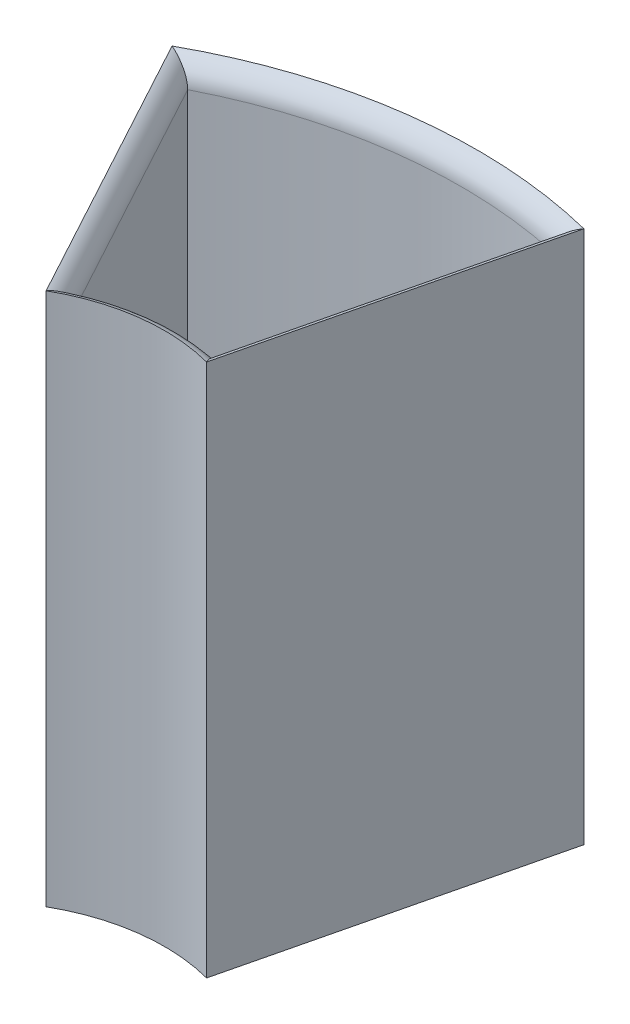
ISO-10303-21;
HEADER;
FILE_DESCRIPTION(('STEP AP214'),'2;1');
FILE_NAME('part.step','',(''),(''),'','','');
FILE_SCHEMA(('AUTOMOTIVE_DESIGN { 1 0 10303 214 1 1 1 1 }'));
ENDSEC;
DATA;
#1=APPLICATION_CONTEXT('core data for automotive mechanical design processes');
#2=APPLICATION_PROTOCOL_DEFINITION('international standard','automotive_design',2000,#1);
#3=PRODUCT_CONTEXT('',#1,'mechanical');
#4=PRODUCT('Part','Part','',(#3));
#5=PRODUCT_RELATED_PRODUCT_CATEGORY('part','',(#4));
#6=PRODUCT_DEFINITION_FORMATION('','',#4);
#7=PRODUCT_DEFINITION_CONTEXT('part definition',#1,'design');
#8=PRODUCT_DEFINITION('design','',#6,#7);
#9=PRODUCT_DEFINITION_SHAPE('','',#8);
#10=(LENGTH_UNIT() NAMED_UNIT(*) SI_UNIT(.MILLI.,.METRE.));
#11=(NAMED_UNIT(*) PLANE_ANGLE_UNIT() SI_UNIT($,.RADIAN.));
#12=(NAMED_UNIT(*) SI_UNIT($,.STERADIAN.) SOLID_ANGLE_UNIT());
#13=UNCERTAINTY_MEASURE_WITH_UNIT(LENGTH_MEASURE(1.E-05),#10,'distance_accuracy_value','');
#14=(GEOMETRIC_REPRESENTATION_CONTEXT(3) GLOBAL_UNCERTAINTY_ASSIGNED_CONTEXT((#13)) GLOBAL_UNIT_ASSIGNED_CONTEXT((#10,
#11,#12)) REPRESENTATION_CONTEXT('',''));
#15=CARTESIAN_POINT('',(0.,0.,0.));
#16=DIRECTION('',(0.,0.,1.));
#17=DIRECTION('',(1.,0.,0.));
#18=AXIS2_PLACEMENT_3D('',#15,#16,#17);
#19=CARTESIAN_POINT('',(0.,2.,0.));
#20=DIRECTION('',(0.,1.,0.));
#21=DIRECTION('',(0.,0.,1.));
#22=AXIS2_PLACEMENT_3D('',#19,#20,#21);
#23=PLANE('',#22);
#24=CARTESIAN_POINT('',(0.,2.,0.));
#25=DIRECTION('',(0.,1.,0.));
#26=DIRECTION('',(0.,0.,1.));
#27=AXIS2_PLACEMENT_3D('',#24,#25,#26);
#28=CIRCLE('',#27,56.);
#29=CARTESIAN_POINT('',(8.68565936566661,2.,-55.3223220895834));
#30=VERTEX_POINT('',#29);
#31=CARTESIAN_POINT('',(-22.6294347498133,2.,-51.2241025583069));
#32=VERTEX_POINT('',#31);
#33=EDGE_CURVE('E193',#30,#32,#28,.T.);
#34=ORIENTED_EDGE('',*,*,#33,.T.);
#35=DIRECTION('',(-0.476482957861193,0.,-0.879183707121469));
#36=VECTOR('',#35,1.);
#37=CARTESIAN_POINT('',(3.96686068085787,2.,-2.14988232303227));
#38=LINE('',#37,#36);
#39=CARTESIAN_POINT('',(-9.20030443380215,2.,-26.4453095713656));
#40=VERTEX_POINT('',#39);
#41=EDGE_CURVE('E202',#32,#40,#38,.F.);
#42=ORIENTED_EDGE('',*,*,#41,.T.);
#43=CARTESIAN_POINT('',(0.,2.,0.));
#44=DIRECTION('',(0.,1.,0.));
#45=DIRECTION('',(0.,0.,1.));
#46=AXIS2_PLACEMENT_3D('',#43,#44,#45);
#47=CIRCLE('',#46,28.);
#48=CARTESIAN_POINT('',(2.08519929447919,2.,-27.9222481885378));
#49=VERTEX_POINT('',#48);
#50=EDGE_CURVE('E199',#40,#49,#47,.F.);
#51=ORIENTED_EDGE('',*,*,#50,.T.);
#52=DIRECTION('',(0.23419288248431,0.,-0.972190153104674));
#53=VECTOR('',#52,1.);
#54=CARTESIAN_POINT('',(9.42633810452789,2.,-58.3970550571114));
#55=LINE('',#54,#53);
#56=EDGE_CURVE('E196',#49,#30,#55,.T.);
#57=ORIENTED_EDGE('',*,*,#56,.T.);
#58=EDGE_LOOP('',(#34,#42,#51,#57));
#59=FACE_BOUND('',#58,.T.);
#60=ADVANCED_FACE('F41',(#59),#23,.T.);
#61=CARTESIAN_POINT('',(-1.46993359146559,65.,-0.354095321523769));
#62=DIRECTION('',(-0.972190153104674,0.,-0.23419288248431));
#63=DIRECTION('',(-0.23419288248431,0.,0.972190153104674));
#64=AXIS2_PLACEMENT_3D('',#61,#62,#63);
#65=PLANE('',#64);
#66=DIRECTION('',(0.,-1.,0.));
#67=VECTOR('',#66,1.);
#68=CARTESIAN_POINT('',(12.3429085638419,65.,-57.6944764096585));
#69=LINE('',#68,#67);
#70=CARTESIAN_POINT('',(12.3429085638419,62.,-57.6944764096585));
#71=VERTEX_POINT('',#70);
#72=CARTESIAN_POINT('',(12.3429085638419,5.,-57.6944764096585));
#73=VERTEX_POINT('',#72);
#74=EDGE_CURVE('E136',#71,#73,#69,.T.);
#75=ORIENTED_EDGE('',*,*,#74,.T.);
#76=DIRECTION('',(0.23419288248431,0.,-0.972190153104674));
#77=VECTOR('',#76,1.);
#78=CARTESIAN_POINT('',(4.37417094919919,5.,-24.6143581778437));
#79=LINE('',#78,#77);
#80=CARTESIAN_POINT('',(4.37417094919919,5.,-24.6143581778437));
#81=VERTEX_POINT('',#80);
#82=EDGE_CURVE('E216',#73,#81,#79,.F.);
#83=ORIENTED_EDGE('',*,*,#82,.T.);
#84=DIRECTION('',(0.,-1.,0.));
#85=VECTOR('',#84,1.);
#86=CARTESIAN_POINT('',(4.37417094919919,65.,-24.6143581778437));
#87=LINE('',#86,#85);
#88=CARTESIAN_POINT('',(4.37417094919919,62.,-24.6143581778437));
#89=VERTEX_POINT('',#88);
#90=EDGE_CURVE('E175',#89,#81,#87,.T.);
#91=ORIENTED_EDGE('',*,*,#90,.F.);
#92=DIRECTION('',(0.23419288248431,0.,-0.972190153104674));
#93=VECTOR('',#92,1.);
#94=CARTESIAN_POINT('',(-1.46993359146559,62.,-0.354095321523769));
#95=LINE('',#94,#93);
#96=EDGE_CURVE('E213',#89,#71,#95,.T.);
#97=ORIENTED_EDGE('',*,*,#96,.T.);
#98=EDGE_LOOP('',(#75,#83,#91,#97));
#99=FACE_BOUND('',#98,.T.);
#100=ADVANCED_FACE('F314',(#99),#65,.T.);
#101=CARTESIAN_POINT('',(0.,65.,0.));
#102=DIRECTION('',(0.,-1.,0.));
#103=DIRECTION('',(0.,0.,-1.));
#104=AXIS2_PLACEMENT_3D('',#101,#102,#103);
#105=CYLINDRICAL_SURFACE('',#104,25.);
#106=ORIENTED_EDGE('',*,*,#90,.T.);
#107=CARTESIAN_POINT('',(0.,5.,0.));
#108=DIRECTION('',(0.,1.,0.));
#109=DIRECTION('',(0.,0.,1.));
#110=AXIS2_PLACEMENT_3D('',#107,#108,#109);
#111=CIRCLE('',#110,25.);
#112=CARTESIAN_POINT('',(-10.5609587870372,5.,-22.6597914707638));
#113=VERTEX_POINT('',#112);
#114=EDGE_CURVE('E210',#81,#113,#111,.T.);
#115=ORIENTED_EDGE('',*,*,#114,.T.);
#116=DIRECTION('',(0.,-1.,0.));
#117=VECTOR('',#116,1.);
#118=CARTESIAN_POINT('',(-10.5609587870372,65.,-22.6597914707638));
#119=LINE('',#118,#117);
#120=CARTESIAN_POINT('',(-10.5609587870372,62.,-22.6597914707638));
#121=VERTEX_POINT('',#120);
#122=EDGE_CURVE('E171',#121,#113,#119,.T.);
#123=ORIENTED_EDGE('',*,*,#122,.F.);
#124=CARTESIAN_POINT('',(0.,62.,0.));
#125=DIRECTION('',(0.,1.,0.));
#126=DIRECTION('',(0.,0.,1.));
#127=AXIS2_PLACEMENT_3D('',#124,#125,#126);
#128=CIRCLE('',#127,25.);
#129=EDGE_CURVE('E206',#121,#89,#128,.F.);
#130=ORIENTED_EDGE('',*,*,#129,.T.);
#131=EDGE_LOOP('',(#106,#115,#123,#130));
#132=FACE_BOUND('',#131,.T.);
#133=ADVANCED_FACE('F320',(#132),#105,.T.);
#134=CARTESIAN_POINT('',(1.32930955949347,65.,-0.720433449448689));
#135=DIRECTION('',(-0.879183707121469,0.,0.476482957861193));
#136=DIRECTION('',(0.476482957861193,0.,0.879183707121469));
#137=AXIS2_PLACEMENT_3D('',#134,#135,#136);
#138=PLANE('',#137);
#139=ORIENTED_EDGE('',*,*,#122,.T.);
#140=DIRECTION('',(-0.476482957861193,0.,-0.879183707121469));
#141=VECTOR('',#140,1.);
#142=CARTESIAN_POINT('',(1.32930955949347,5.,-0.720433449448689));
#143=LINE('',#142,#141);
#144=CARTESIAN_POINT('',(-26.7739522340054,5.,-52.5752363929179));
#145=VERTEX_POINT('',#144);
#146=EDGE_CURVE('E189',#113,#145,#143,.T.);
#147=ORIENTED_EDGE('',*,*,#146,.T.);
#148=DIRECTION('',(0.,-1.,0.));
#149=VECTOR('',#148,1.);
#150=CARTESIAN_POINT('',(-26.7739522340054,65.,-52.5752363929179));
#151=LINE('',#150,#149);
#152=CARTESIAN_POINT('',(-26.7739522340054,62.,-52.5752363929179));
#153=VERTEX_POINT('',#152);
#154=EDGE_CURVE('E167',#153,#145,#151,.T.);
#155=ORIENTED_EDGE('',*,*,#154,.F.);
#156=DIRECTION('',(-0.476482957861193,0.,-0.879183707121469));
#157=VECTOR('',#156,1.);
#158=CARTESIAN_POINT('',(-10.5609587870372,62.,-22.6597914707638));
#159=LINE('',#158,#157);
#160=EDGE_CURVE('E179',#153,#121,#159,.F.);
#161=ORIENTED_EDGE('',*,*,#160,.T.);
#162=EDGE_LOOP('',(#139,#147,#155,#161));
#163=FACE_BOUND('',#162,.T.);
#164=ADVANCED_FACE('F339',(#163),#138,.F.);
#165=CARTESIAN_POINT('',(0.,65.,0.));
#166=DIRECTION('',(0.,-1.,0.));
#167=DIRECTION('',(0.,0.,-1.));
#168=AXIS2_PLACEMENT_3D('',#165,#166,#167);
#169=CYLINDRICAL_SURFACE('',#168,23.);
#170=DIRECTION('',(0.,-1.,0.));
#171=VECTOR('',#170,1.);
#172=CARTESIAN_POINT('',(5.85967035705195,65.,-22.2410490603903));
#173=LINE('',#172,#171);
#174=CARTESIAN_POINT('',(5.85967035705195,64.8284271247462,-22.2410490603903));
#175=VERTEX_POINT('',#174);
#176=CARTESIAN_POINT('',(5.85967035705195,0.,-22.2410490603903));
#177=VERTEX_POINT('',#176);
#178=EDGE_CURVE('E125',#175,#177,#173,.T.);
#179=ORIENTED_EDGE('',*,*,#178,.F.);
#180=CARTESIAN_POINT('',(0.,64.8284271247462,0.));
#181=DIRECTION('',(0.,1.,0.));
#182=DIRECTION('',(0.,0.,1.));
#183=AXIS2_PLACEMENT_3D('',#180,#181,#182);
#184=CIRCLE('',#183,23.);
#185=CARTESIAN_POINT('',(-11.385698648489,64.8284271247462,-19.9841403689475));
#186=VERTEX_POINT('',#185);
#187=EDGE_CURVE('E225',#175,#186,#184,.T.);
#188=ORIENTED_EDGE('',*,*,#187,.T.);
#189=DIRECTION('',(0.,-1.,0.));
#190=VECTOR('',#189,1.);
#191=CARTESIAN_POINT('',(-11.385698648489,65.,-19.9841403689475));
#192=LINE('',#191,#190);
#193=CARTESIAN_POINT('',(-11.385698648489,0.,-19.9841403689475));
#194=VERTEX_POINT('',#193);
#195=EDGE_CURVE('E150',#186,#194,#192,.T.);
#196=ORIENTED_EDGE('',*,*,#195,.T.);
#197=CARTESIAN_POINT('',(0.,0.,0.));
#198=DIRECTION('',(0.,1.,0.));
#199=DIRECTION('',(0.,0.,1.));
#200=AXIS2_PLACEMENT_3D('',#197,#198,#199);
#201=CIRCLE('',#200,23.);
#202=EDGE_CURVE('E143',#177,#194,#201,.T.);
#203=ORIENTED_EDGE('',*,*,#202,.F.);
#204=EDGE_LOOP('',(#179,#188,#196,#203));
#205=FACE_BOUND('',#204,.T.);
#206=ADVANCED_FACE('F149',(#205),#169,.F.);
#207=CARTESIAN_POINT('',(0.474446714743756,65.,0.114290443444852));
#208=DIRECTION('',(-0.972190153104674,0.,-0.23419288248431));
#209=DIRECTION('',(-0.23419288248431,0.,0.972190153104674));
#210=AXIS2_PLACEMENT_3D('',#207,#208,#209);
#211=PLANE('',#210);
#212=DIRECTION('',(0.,-1.,0.));
#213=VECTOR('',#212,1.);
#214=CARTESIAN_POINT('',(14.7597553599294,65.,-59.1874110070295));
#215=LINE('',#214,#213);
#216=CARTESIAN_POINT('',(14.7597553599294,64.8284271247462,-59.1874110070295));
#217=VERTEX_POINT('',#216);
#218=CARTESIAN_POINT('',(14.7597553599294,0.,-59.1874110070295));
#219=VERTEX_POINT('',#218);
#220=EDGE_CURVE('E137',#217,#219,#215,.T.);
#221=ORIENTED_EDGE('',*,*,#220,.F.);
#222=DIRECTION('',(0.23419288248431,0.,-0.972190153104674));
#223=VECTOR('',#222,1.);
#224=CARTESIAN_POINT('',(10.3097128584907,64.8284271247462,-40.7142300337099));
#225=LINE('',#224,#223);
#226=EDGE_CURVE('E56',#217,#175,#225,.F.);
#227=ORIENTED_EDGE('',*,*,#226,.T.);
#228=ORIENTED_EDGE('',*,*,#178,.T.);
#229=DIRECTION('',(0.23419288248431,0.,-0.972190153104674));
#230=VECTOR('',#229,1.);
#231=CARTESIAN_POINT('',(0.474446714743756,0.,0.114290443444852));
#232=LINE('',#231,#230);
#233=EDGE_CURVE('E128',#177,#219,#232,.T.);
#234=ORIENTED_EDGE('',*,*,#233,.T.);
#235=EDGE_LOOP('',(#221,#227,#228,#234));
#236=FACE_BOUND('',#235,.T.);
#237=ADVANCED_FACE('F127',(#236),#211,.F.);
#238=CARTESIAN_POINT('',(0.,65.,0.));
#239=DIRECTION('',(0.,-1.,0.));
#240=DIRECTION('',(0.,0.,-1.));
#241=AXIS2_PLACEMENT_3D('',#238,#239,#240);
#242=CYLINDRICAL_SURFACE('',#241,61.);
#243=DIRECTION('',(0.,-1.,0.));
#244=VECTOR('',#243,1.);
#245=CARTESIAN_POINT('',(-29.4935881044002,65.,-53.3959573444281));
#246=LINE('',#245,#244);
#247=CARTESIAN_POINT('',(-29.4935881044002,64.8284271247462,-53.3959573444281));
#248=VERTEX_POINT('',#247);
#249=CARTESIAN_POINT('',(-29.4935881044002,0.,-53.3959573444281));
#250=VERTEX_POINT('',#249);
#251=EDGE_CURVE('E182',#248,#250,#246,.T.);
#252=ORIENTED_EDGE('',*,*,#251,.F.);
#253=CARTESIAN_POINT('',(0.,64.8284271247462,0.));
#254=DIRECTION('',(0.,-1.,0.));
#255=DIRECTION('',(0.,0.,-1.));
#256=AXIS2_PLACEMENT_3D('',#253,#254,#255);
#257=CIRCLE('',#256,61.);
#258=EDGE_CURVE('E11',#248,#217,#257,.T.);
#259=ORIENTED_EDGE('',*,*,#258,.T.);
#260=ORIENTED_EDGE('',*,*,#220,.T.);
#261=CARTESIAN_POINT('',(0.,0.,0.));
#262=DIRECTION('',(0.,1.,0.));
#263=DIRECTION('',(0.,0.,1.));
#264=AXIS2_PLACEMENT_3D('',#261,#262,#263);
#265=CIRCLE('',#264,61.);
#266=EDGE_CURVE('E146',#219,#250,#265,.T.);
#267=ORIENTED_EDGE('',*,*,#266,.T.);
#268=EDGE_LOOP('',(#252,#259,#260,#267));
#269=FACE_BOUND('',#268,.T.);
#270=ADVANCED_FACE('F336',(#269),#242,.T.);
#271=CARTESIAN_POINT('',(-0.429057854749474,65.,0.232532466273698));
#272=DIRECTION('',(-0.879183707121469,0.,0.476482957861193));
#273=DIRECTION('',(0.476482957861193,0.,0.879183707121469));
#274=AXIS2_PLACEMENT_3D('',#271,#272,#273);
#275=PLANE('',#274);
#276=ORIENTED_EDGE('',*,*,#195,.F.);
#277=DIRECTION('',(0.476482957861193,0.,0.879183707121469));
#278=VECTOR('',#277,1.);
#279=CARTESIAN_POINT('',(-20.4396433764446,64.8284271247462,-36.6900488566878));
#280=LINE('',#279,#278);
#281=EDGE_CURVE('E70',#186,#248,#280,.F.);
#282=ORIENTED_EDGE('',*,*,#281,.T.);
#283=ORIENTED_EDGE('',*,*,#251,.T.);
#284=DIRECTION('',(-0.476482957861193,0.,-0.879183707121469));
#285=VECTOR('',#284,1.);
#286=CARTESIAN_POINT('',(-0.429057854749474,0.,0.232532466273698));
#287=LINE('',#286,#285);
#288=EDGE_CURVE('E161',#194,#250,#287,.T.);
#289=ORIENTED_EDGE('',*,*,#288,.F.);
#290=EDGE_LOOP('',(#276,#282,#283,#289));
#291=FACE_BOUND('',#290,.T.);
#292=ADVANCED_FACE('F330',(#291),#275,.T.);
#293=CARTESIAN_POINT('',(0.,65.,0.));
#294=DIRECTION('',(0.,-1.,0.));
#295=DIRECTION('',(0.,0.,-1.));
#296=AXIS2_PLACEMENT_3D('',#293,#294,#295);
#297=CYLINDRICAL_SURFACE('',#296,59.);
#298=ORIENTED_EDGE('',*,*,#154,.T.);
#299=CARTESIAN_POINT('',(0.,5.,0.));
#300=DIRECTION('',(0.,1.,0.));
#301=DIRECTION('',(0.,0.,1.));
#302=AXIS2_PLACEMENT_3D('',#299,#300,#301);
#303=CIRCLE('',#302,59.);
#304=EDGE_CURVE('E222',#145,#73,#303,.F.);
#305=ORIENTED_EDGE('',*,*,#304,.T.);
#306=ORIENTED_EDGE('',*,*,#74,.F.);
#307=CARTESIAN_POINT('',(0.,62.,0.));
#308=DIRECTION('',(0.,1.,0.));
#309=DIRECTION('',(0.,0.,1.));
#310=AXIS2_PLACEMENT_3D('',#307,#308,#309);
#311=CIRCLE('',#310,59.);
#312=EDGE_CURVE('E219',#71,#153,#311,.T.);
#313=ORIENTED_EDGE('',*,*,#312,.T.);
#314=EDGE_LOOP('',(#298,#305,#306,#313));
#315=FACE_BOUND('',#314,.T.);
#316=ADVANCED_FACE('F326',(#315),#297,.F.);
#317=CARTESIAN_POINT('',(0.,0.,0.));
#318=DIRECTION('',(0.,1.,0.));
#319=DIRECTION('',(0.,0.,1.));
#320=AXIS2_PLACEMENT_3D('',#317,#318,#319);
#321=PLANE('',#320);
#322=ORIENTED_EDGE('',*,*,#202,.T.);
#323=ORIENTED_EDGE('',*,*,#288,.T.);
#324=ORIENTED_EDGE('',*,*,#266,.F.);
#325=ORIENTED_EDGE('',*,*,#233,.F.);
#326=EDGE_LOOP('',(#322,#323,#324,#325));
#327=FACE_BOUND('',#326,.T.);
#328=ADVANCED_FACE('F141',(#327),#321,.F.);
#329=CARTESIAN_POINT('',(-4.38650405077962,5.,-1.0566739689767));
#330=DIRECTION('',(-0.23419288248431,0.,0.972190153104674));
#331=DIRECTION('',(0.972190153104674,0.,0.23419288248431));
#332=AXIS2_PLACEMENT_3D('',#329,#330,#331);
#333=CYLINDRICAL_SURFACE('',#332,3.);
#334=CARTESIAN_POINT('',(12.3429085638419,5.,-57.6944764096585));
#335=CARTESIAN_POINT('',(12.3429288660334,4.93337046723494,-57.6944887474847));
#336=CARTESIAN_POINT('',(12.3402179017331,4.86675388598784,-57.6927826438431));
#337=CARTESIAN_POINT('',(12.3294897373083,4.73417143842667,-57.6860286935827));
#338=CARTESIAN_POINT('',(12.3214767431209,4.66820509835827,-57.6809834957638));
#339=CARTESIAN_POINT('',(12.3003915406696,4.53800357085029,-57.6677036468582));
#340=CARTESIAN_POINT('',(12.2873634926513,4.47375836767791,-57.6594968350051));
#341=CARTESIAN_POINT('',(12.2565269053916,4.34690426820063,-57.6400634453613));
#342=CARTESIAN_POINT('',(12.2387176762911,4.28429560945834,-57.6288364317965));
#343=CARTESIAN_POINT('',(12.1787163428119,4.09993013516925,-57.5909911590831));
#344=CARTESIAN_POINT('',(12.129865336399,3.98113000218222,-57.5601550772575));
#345=CARTESIAN_POINT('',(12.0173939876592,3.75369409817656,-57.4890503554816));
#346=CARTESIAN_POINT('',(11.9537400583254,3.64508224230689,-57.4487602630065));
#347=CARTESIAN_POINT('',(11.7858772044742,3.3964422998175,-57.3423137198884));
#348=CARTESIAN_POINT('',(11.6757856212972,3.26200945995745,-57.2723523570856));
#349=CARTESIAN_POINT('',(11.4391420488641,3.01575307544449,-57.1215009232084));
#350=CARTESIAN_POINT('',(11.3125588163913,2.90397350121494,-57.0405900969565));
#351=CARTESIAN_POINT('',(10.993395407197,2.66005141986524,-56.8358852071737));
#352=CARTESIAN_POINT('',(10.7951686690945,2.53860058397452,-56.7081930470803));
#353=CARTESIAN_POINT('',(10.3858585301138,2.3344031661369,-56.4431306614665));
#354=CARTESIAN_POINT('',(10.1747570193466,2.2517125934809,-56.3057467587539));
#355=CARTESIAN_POINT('',(9.75293767688449,2.12380147081336,-56.0297179360774));
#356=CARTESIAN_POINT('',(9.54243348998027,2.07744296751316,-55.8912615075257));
#357=CARTESIAN_POINT('',(9.11935840827955,2.01579214121463,-55.6114738021405));
#358=CARTESIAN_POINT('',(8.90679250839941,2.00043766454001,-55.4701488517912));
#359=CARTESIAN_POINT('',(8.69174030572387,2.00000308038561,-55.3263876422372));
#360=CARTESIAN_POINT('',(8.68869977603637,2.00000000588677,-55.3243549056962));
#361=CARTESIAN_POINT('',(8.68565936566661,2.,-55.3223220895834));
#362=B_SPLINE_CURVE_WITH_KNOTS('',3,(#334,#335,#336,#337,#338,#339,#340,#341,#342,#343,#344,
#345,#346,#347,#348,#349,#350,#351,#352,#353,#354,#355,#356,#357,#358,#359,#360,#361),
.UNSPECIFIED.,.F.,.F.,(4,2,2,2,2,2,2,2,2,2,2,2,2,4),(0.,0.199790574429052,0.399422850850688,
0.597336047832153,0.795277816339575,1.18964085340849,1.58490756223034,2.14371959352384,
2.70360611465259,3.49500121373229,4.28753639440931,5.0541283888798,5.81918206689892,
5.83015437267743),.UNSPECIFIED.);
#363=EDGE_CURVE('E156',#30,#73,#362,.F.);
#364=ORIENTED_EDGE('',*,*,#363,.F.);
#365=ORIENTED_EDGE('',*,*,#56,.F.);
#366=CARTESIAN_POINT('',(4.37417094919919,5.,-24.6143581778437));
#367=CARTESIAN_POINT('',(4.37418315299722,4.93125301018801,-24.6143379149249));
#368=CARTESIAN_POINT('',(4.37239491344077,4.86251884545374,-24.6170732864234));
#369=CARTESIAN_POINT('',(4.36531178061874,4.7257060756013,-24.6278994368479));
#370=CARTESIAN_POINT('',(4.36001953488606,4.65762701487462,-24.6359861724245));
#371=CARTESIAN_POINT('',(4.34607973212947,4.52320207544919,-24.6572720181164));
#372=CARTESIAN_POINT('',(4.33746003508428,4.45684656398287,-24.6704286773691));
#373=CARTESIAN_POINT('',(4.31703397584652,4.32579305603028,-24.7015756159135));
#374=CARTESIAN_POINT('',(4.3052271728883,4.26109529016053,-24.719566563769));
#375=CARTESIAN_POINT('',(4.26538906927016,4.07050029097725,-24.7801980917038));
#376=CARTESIAN_POINT('',(4.23288635126831,3.94760313964668,-24.8295797538118));
#377=CARTESIAN_POINT('',(4.15775737161105,3.71219336196557,-24.9433306727212));
#378=CARTESIAN_POINT('',(4.11510886223521,3.59970432227003,-25.0077328604034));
#379=CARTESIAN_POINT('',(4.00323077134318,3.34467443425928,-25.1759886091932));
#380=CARTESIAN_POINT('',(3.93012058244796,3.20751581808216,-25.2854339680241));
#381=CARTESIAN_POINT('',(3.7718896601732,2.95619142243703,-25.5207506559777));
#382=CARTESIAN_POINT('',(3.68674698780477,2.84206858849436,-25.6466519572214));
#383=CARTESIAN_POINT('',(3.4786658492601,2.60320992396438,-25.9521860952219));
#384=CARTESIAN_POINT('',(3.35237643413448,2.48685749154731,-26.1360804027908));
#385=CARTESIAN_POINT('',(3.08917673389787,2.29167767734002,-26.515620393135));
#386=CARTESIAN_POINT('',(2.95225888117402,2.21287732355222,-26.711274426225));
#387=CARTESIAN_POINT('',(2.69534490312593,2.10190766484455,-27.0748659856854));
#388=CARTESIAN_POINT('',(2.57641316458715,2.06409907015512,-27.2418816642659));
#389=CARTESIAN_POINT('',(2.3357143197521,2.01339930523404,-27.5772440263103));
#390=CARTESIAN_POINT('',(2.21395387746367,2.00045460268006,-27.7455870649341));
#391=CARTESIAN_POINT('',(2.08952957492837,2.00000392235841,-27.9163078740774));
#392=CARTESIAN_POINT('',(2.08736451003586,2.00000000082004,-27.91927812821));
#393=CARTESIAN_POINT('',(2.08519929447919,2.,-27.9222481885378));
#394=B_SPLINE_CURVE_WITH_KNOTS('',3,(#366,#367,#368,#369,#370,#371,#372,#373,#374,#375,#376,
#377,#378,#379,#380,#381,#382,#383,#384,#385,#386,#387,#388,#389,#390,#391,#392,#393),
.UNSPECIFIED.,.F.,.F.,(4,2,2,2,2,2,2,2,2,2,2,2,2,4),(0.,0.206142437845146,0.412129297477611,
0.616427628855155,0.820754228469359,1.22790419753151,1.63595533210953,2.20309585575548,
2.77128412571264,3.52214025073019,4.27353598913288,4.89759727588257,5.52031343686156,
5.53134018441532),.UNSPECIFIED.);
#395=EDGE_CURVE('E152',#81,#49,#394,.T.);
#396=ORIENTED_EDGE('',*,*,#395,.F.);
#397=ORIENTED_EDGE('',*,*,#82,.F.);
#398=EDGE_LOOP('',(#364,#365,#396,#397));
#399=FACE_BOUND('',#398,.T.);
#400=ADVANCED_FACE('F270',(#399),#333,.F.);
#401=CARTESIAN_POINT('',(0.,5.,0.));
#402=DIRECTION('',(0.,1.,0.));
#403=DIRECTION('',(0.,0.,1.));
#404=AXIS2_PLACEMENT_3D('',#401,#402,#403);
#405=TOROIDAL_SURFACE('',#404,28.,3.);
#406=ORIENTED_EDGE('',*,*,#395,.T.);
#407=ORIENTED_EDGE('',*,*,#50,.F.);
#408=CARTESIAN_POINT('',(-10.5609587870372,5.,-22.6597914707638));
#409=CARTESIAN_POINT('',(-10.5609653655165,4.931253010188,-22.6597687498005));
#410=CARTESIAN_POINT('',(-10.5599412517593,4.86251884545373,-22.6628721751594));
#411=CARTESIAN_POINT('',(-10.5558825908979,4.7257060756013,-22.6751564568071));
#412=CARTESIAN_POINT('',(-10.5528495616755,4.65762701487461,-22.6843327246169));
#413=CARTESIAN_POINT('',(-10.5448567749941,4.52320207544919,-22.7084888975087));
#414=CARTESIAN_POINT('',(-10.5399130152359,4.45684656398286,-22.7234206120551));
#415=CARTESIAN_POINT('',(-10.5281900012097,4.32579305603027,-22.7587749133325));
#416=CARTESIAN_POINT('',(-10.5214104930637,4.26109529016052,-22.7791982595356));
#417=CARTESIAN_POINT('',(-10.4985165524644,4.07050029097725,-22.8480395564688));
#418=CARTESIAN_POINT('',(-10.4798159941617,3.94760313964668,-22.9041222128718));
#419=CARTESIAN_POINT('',(-10.436489077719,3.71219336196556,-23.0333755047009));
#420=CARTESIAN_POINT('',(-10.4118496953206,3.59970432227002,-23.1065836870663));
#421=CARTESIAN_POINT('',(-10.3470371971265,3.34467443425926,-23.2979630075279));
#422=CARTESIAN_POINT('',(-10.3045531192145,3.20751581808213,-23.4225362366499));
#423=CARTESIAN_POINT('',(-10.2122058540791,2.95619142243701,-23.690646197329));
#424=CARTESIAN_POINT('',(-10.1623291795437,2.84206858849435,-23.8342175372621));
#425=CARTESIAN_POINT('',(-10.0398798211076,2.60320992396439,-24.1830083403524));
#426=CARTESIAN_POINT('',(-9.96516565838874,2.48685749154733,-24.3932080706524));
#427=CARTESIAN_POINT('',(-9.80849816781054,2.29167767734004,-24.8276962567645));
#428=CARTESIAN_POINT('',(-9.72653967601092,2.21287732355223,-25.0519947290751));
#429=CARTESIAN_POINT('',(-9.57184215610546,2.10190766484453,-25.4694540583066));
#430=CARTESIAN_POINT('',(-9.49989444677685,2.0640990701551,-25.6614502104711));
#431=CARTESIAN_POINT('',(-9.35360166012747,2.01339930523404,-26.0474583300169));
#432=CARTESIAN_POINT('',(-9.27926208444911,2.00045460268006,-26.2414650604345));
#433=CARTESIAN_POINT('',(-9.20296024017392,2.00000392235841,-26.4384549847863));
#434=CARTESIAN_POINT('',(-9.20163243471936,2.00000000082004,-26.4418823523295));
#435=CARTESIAN_POINT('',(-9.20030443380215,2.,-26.4453095713656));
#436=B_SPLINE_CURVE_WITH_KNOTS('',3,(#408,#409,#410,#411,#412,#413,#414,#415,#416,#417,#418,
#419,#420,#421,#422,#423,#424,#425,#426,#427,#428,#429,#430,#431,#432,#433,#434,#435),
.UNSPECIFIED.,.F.,.F.,(4,2,2,2,2,2,2,2,2,2,2,2,2,4),(0.,0.206142437845148,0.412129297477615,
0.616427628855159,0.820754228469363,1.22790419753151,1.63595533210953,2.20309585575551,
2.77128412571265,3.5221402507301,4.27353598913288,4.89759727588266,5.52031343686155,
5.5313401844153),.UNSPECIFIED.);
#437=EDGE_CURVE('E241',#113,#40,#436,.T.);
#438=ORIENTED_EDGE('',*,*,#437,.F.);
#439=ORIENTED_EDGE('',*,*,#114,.F.);
#440=EDGE_LOOP('',(#406,#407,#438,#439));
#441=FACE_BOUND('',#440,.T.);
#442=ADVANCED_FACE('F254',(#441),#405,.F.);
#443=CARTESIAN_POINT('',(0.,5.,0.));
#444=DIRECTION('',(0.,1.,0.));
#445=DIRECTION('',(0.,0.,1.));
#446=AXIS2_PLACEMENT_3D('',#443,#444,#445);
#447=TOROIDAL_SURFACE('',#446,56.,3.);
#448=ORIENTED_EDGE('',*,*,#363,.T.);
#449=ORIENTED_EDGE('',*,*,#304,.F.);
#450=CARTESIAN_POINT('',(-26.7739522340054,5.,-52.5752363929179));
#451=CARTESIAN_POINT('',(-26.7739750274088,4.93337046723494,-52.5752430908055));
#452=CARTESIAN_POINT('',(-26.7709163235988,4.86675388598784,-52.574292066055));
#453=CARTESIAN_POINT('',(-26.7588114377349,4.73417143842667,-52.5705262866845));
#454=CARTESIAN_POINT('',(-26.7497700015981,4.66820509835827,-52.5677130093315));
#455=CARTESIAN_POINT('',(-26.7259775430329,4.53800357085029,-52.5603063187891));
#456=CARTESIAN_POINT('',(-26.7112763576172,4.47375836767791,-52.5557284433724));
#457=CARTESIAN_POINT('',(-26.6764774029331,4.34690426820063,-52.544884804695));
#458=CARTESIAN_POINT('',(-26.656378854899,4.28429560945834,-52.5386187978596));
#459=CARTESIAN_POINT('',(-26.5886593512468,4.09993013516925,-52.5174884047935));
#460=CARTESIAN_POINT('',(-26.5335183607424,3.98113000218222,-52.500261799321));
#461=CARTESIAN_POINT('',(-26.406537122821,3.75369409817656,-52.4604943382237));
#462=CARTESIAN_POINT('',(-26.3346588990654,3.64508224230689,-52.437941395599));
#463=CARTESIAN_POINT('',(-26.1450569609394,3.3964422998175,-52.3782764200797));
#464=CARTESIAN_POINT('',(-26.0206695689429,3.26200945995746,-52.3390014193292));
#465=CARTESIAN_POINT('',(-25.7531763991032,3.01575307544449,-52.2541265728446));
#466=CARTESIAN_POINT('',(-25.6100350892298,2.90397350121494,-52.2085147108376));
#467=CARTESIAN_POINT('',(-25.2489428343631,2.66005141986523,-52.0928351657795));
#468=CARTESIAN_POINT('',(-25.0245323784281,2.5386005839745,-52.0204537129403));
#469=CARTESIAN_POINT('',(-24.5607972917942,2.33440316613689,-51.8696471230168));
#470=CARTESIAN_POINT('',(-24.3214516414999,2.25171259348089,-51.7912134296324));
#471=CARTESIAN_POINT('',(-23.8428065967425,2.12380147081337,-51.6330287598552));
#472=CARTESIAN_POINT('',(-23.6037621572317,2.07744296751317,-51.553404949029));
#473=CARTESIAN_POINT('',(-23.1229363768542,2.01579214121464,-51.3919111294411));
#474=CARTESIAN_POINT('',(-22.8811614907045,2.00043766454001,-51.3100459487451));
#475=CARTESIAN_POINT('',(-22.6363571027707,2.00000308038561,-51.226466364537));
#476=CARTESIAN_POINT('',(-22.6328958788805,2.00000000588677,-51.2252845152202));
#477=CARTESIAN_POINT('',(-22.6294347498133,2.,-51.2241025583069));
#478=B_SPLINE_CURVE_WITH_KNOTS('',3,(#450,#451,#452,#453,#454,#455,#456,#457,#458,#459,#460,
#461,#462,#463,#464,#465,#466,#467,#468,#469,#470,#471,#472,#473,#474,#475,#476,#477),
.UNSPECIFIED.,.F.,.F.,(4,2,2,2,2,2,2,2,2,2,2,2,2,4),(0.,0.199790574429052,0.399422850850688,
0.597336047832154,0.795277816339575,1.18964085340849,1.58490756223034,2.14371959352383,
2.70360611465259,3.49500121373236,4.28753639440932,5.05412838887971,5.81918206689891,
5.83015437267742),.UNSPECIFIED.);
#479=EDGE_CURVE('E232',#32,#145,#478,.F.);
#480=ORIENTED_EDGE('',*,*,#479,.F.);
#481=ORIENTED_EDGE('',*,*,#33,.F.);
#482=EDGE_LOOP('',(#448,#449,#480,#481));
#483=FACE_BOUND('',#482,.T.);
#484=ADVANCED_FACE('F251',(#483),#447,.F.);
#485=CARTESIAN_POINT('',(3.96686068085787,5.,-2.14988232303227));
#486=DIRECTION('',(-0.476482957861193,0.,-0.879183707121469));
#487=DIRECTION('',(-0.879183707121469,0.,0.476482957861193));
#488=AXIS2_PLACEMENT_3D('',#485,#486,#487);
#489=CYLINDRICAL_SURFACE('',#488,3.);
#490=ORIENTED_EDGE('',*,*,#437,.T.);
#491=ORIENTED_EDGE('',*,*,#41,.F.);
#492=ORIENTED_EDGE('',*,*,#479,.T.);
#493=ORIENTED_EDGE('',*,*,#146,.F.);
#494=EDGE_LOOP('',(#490,#491,#492,#493));
#495=FACE_BOUND('',#494,.T.);
#496=ADVANCED_FACE('F248',(#495),#489,.F.);
#497=CARTESIAN_POINT('',(0.,62.,0.));
#498=DIRECTION('',(0.,1.,0.));
#499=DIRECTION('',(0.,0.,1.));
#500=AXIS2_PLACEMENT_3D('',#497,#498,#499);
#501=TOROIDAL_SURFACE('',#500,62.,3.);
#502=CARTESIAN_POINT('',(-30.8416754332027,59.,-53.7846730628065));
#503=CARTESIAN_POINT('',(-30.8381624881006,59.0000000045595,-53.7836752634881));
#504=CARTESIAN_POINT('',(-30.8346494676755,59.000003418577,-53.7826773239));
#505=CARTESIAN_POINT('',(-30.5215285323779,59.0006116207127,-53.6937188378344));
#506=CARTESIAN_POINT('',(-30.2113994467926,59.0276961522276,-53.6046875764411));
#507=CARTESIAN_POINT('',(-29.7533115905821,59.1084529787516,-53.4718358259983));
#508=CARTESIAN_POINT('',(-29.6015368529418,59.1421559642639,-53.4275898412854));
#509=CARTESIAN_POINT('',(-29.3015615122828,59.2233627224735,-53.3397035541791));
#510=CARTESIAN_POINT('',(-29.1533590612562,59.2708591860816,-53.2960629438005));
#511=CARTESIAN_POINT('',(-28.7980901562254,59.4041163334857,-53.1909406311809));
#512=CARTESIAN_POINT('',(-28.5936586942824,59.4975255073266,-53.1300126040667));
#513=CARTESIAN_POINT('',(-28.2013147355519,59.715904283529,-53.0123263367508));
#514=CARTESIAN_POINT('',(-28.0133647448407,59.8407996074568,-52.9555586831172));
#515=CARTESIAN_POINT('',(-27.7101959307107,60.0858716293648,-52.8634787052937));
#516=CARTESIAN_POINT('',(-27.5890868999949,60.1981186278238,-52.8265263977068));
#517=CARTESIAN_POINT('',(-27.3650931107198,60.4410840437151,-52.7579412895905));
#518=CARTESIAN_POINT('',(-27.2621878388188,60.5717813673363,-52.7263025034545));
#519=CARTESIAN_POINT('',(-27.0997227599554,60.8218608896111,-52.6762162886859));
#520=CARTESIAN_POINT('',(-27.0355999238151,60.9379903958213,-52.6563939514549));
#521=CARTESIAN_POINT('',(-26.9265015424971,61.1796815493889,-52.6226161898051));
#522=CARTESIAN_POINT('',(-26.8814923370813,61.3052261534211,-52.6086504521136));
#523=CARTESIAN_POINT('',(-26.823455777403,61.5260285572978,-52.5906279207651));
#524=CARTESIAN_POINT('',(-26.8049723169767,61.6197392358627,-52.58488232247));
#525=CARTESIAN_POINT('',(-26.7802217075517,61.8089787830054,-52.5771869423089));
#526=CARTESIAN_POINT('',(-26.7739559640446,61.9045078594904,-52.5752375971532));
#527=CARTESIAN_POINT('',(-26.7739496341426,62.0665586721149,-52.5752355535577));
#528=CARTESIAN_POINT('',(-26.776989236216,62.13309940005,-52.5761811570805));
#529=CARTESIAN_POINT('',(-26.7890559766476,62.2655889024083,-52.5799337267751));
#530=CARTESIAN_POINT('',(-26.7980845917398,62.3315375267684,-52.5827411520234));
#531=CARTESIAN_POINT('',(-26.8339252989277,62.5277220214926,-52.5938805896775));
#532=CARTESIAN_POINT('',(-26.86949226341,62.6562991037579,-52.6049297674467));
#533=CARTESIAN_POINT('',(-26.9607544023121,62.9040817885219,-52.6332266919581));
#534=CARTESIAN_POINT('',(-27.0163041059554,63.0233477274591,-52.6504296354486));
#535=CARTESIAN_POINT('',(-27.1440629884156,63.2515918381213,-52.6898973651749));
#536=CARTESIAN_POINT('',(-27.2162789479519,63.3605657970214,-52.7121642116217));
#537=CARTESIAN_POINT('',(-27.4077723241493,63.6115319043385,-52.7710361655817));
#538=CARTESIAN_POINT('',(-27.5339763848554,63.7477474027411,-52.8097033274843));
#539=CARTESIAN_POINT('',(-27.8056650548452,63.9973859681701,-52.8925347735397));
#540=CARTESIAN_POINT('',(-27.9511925147551,64.1107569271654,-52.9367112612729));
#541=CARTESIAN_POINT('',(-28.3152187073912,64.3557028751989,-53.0466203957499));
#542=CARTESIAN_POINT('',(-28.5400306984616,64.4771149949801,-53.1140372602535));
#543=CARTESIAN_POINT('',(-29.005452401503,64.6810719136977,-53.252478516556));
#544=CARTESIAN_POINT('',(-29.2460799072676,64.7635720500254,-53.3235069506196));
#545=CARTESIAN_POINT('',(-29.7099445454924,64.8851205445547,-53.4592890647499));
#546=CARTESIAN_POINT('',(-29.9322749425711,64.9278831646085,-53.5238976505249));
#547=CARTESIAN_POINT('',(-30.3801467129259,64.9850681671614,-53.6530665052471));
#548=CARTESIAN_POINT('',(-30.6056800792258,64.9995517941932,-53.7176265752383));
#549=CARTESIAN_POINT('',(-30.834649418957,64.9999965819515,-53.782677309119));
#550=CARTESIAN_POINT('',(-30.8381624390627,64.9999999960289,-53.7836752486062));
#551=CARTESIAN_POINT('',(-30.8416754332027,65.,-53.7846730628065));
#552=B_SPLINE_CURVE_WITH_KNOTS('',3,(#502,#503,#504,#505,#506,#507,#508,#509,#510,#511,#512,
#513,#514,#515,#516,#517,#518,#519,#520,#521,#522,#523,#524,#525,#526,#527,#528,#529,#530,#531,
#532,#533,#534,#535,#536,#537,#538,#539,#540,#541,#542,#543,#544,#545,#546,#547,#548,#549,#550,
#551),.UNSPECIFIED.,.F.,.F.,(4,2,2,2,2,2,2,2,2,2,2,2,2,2,2,2,2,2,2,2,2,2,2,2,4),(0.,
0.0109560339910995,0.976509573370463,1.46100961066158,1.94525338099601,2.64149812253411,
3.33611548875144,3.84209480744344,4.34750026784123,4.74834972723778,5.14849030970206,
5.43477042554956,5.72108347231055,5.9206456153298,6.1202569834539,6.51947207195576,
6.91583788351622,7.31236524295516,7.87825140703976,8.44541409020958,9.23392132841698,
10.0233314145048,10.7279846208261,11.4311100415996,11.4420660755907),.UNSPECIFIED.);
#553=EDGE_CURVE('E291',#153,#248,#552,.T.);
#554=ORIENTED_EDGE('',*,*,#553,.F.);
#555=ORIENTED_EDGE('',*,*,#312,.F.);
#556=CARTESIAN_POINT('',(15.9624131277873,65.,-59.9099438085018));
#557=CARTESIAN_POINT('',(15.9592752564952,64.9999999954405,-59.908075614046));
#558=CARTESIAN_POINT('',(15.9561373485129,64.999996581423,-59.9062072646613));
#559=CARTESIAN_POINT('',(15.6764534895393,64.9993883792873,-59.7396681659652));
#560=CARTESIAN_POINT('',(15.3996794502682,64.9723038477723,-59.5738286458952));
#561=CARTESIAN_POINT('',(14.9912059768099,64.8915470212482,-59.327569649949));
#562=CARTESIAN_POINT('',(14.8559285815027,64.8578440357359,-59.245757031925));
#563=CARTESIAN_POINT('',(14.5886716958289,64.7766372775261,-59.0836368249029));
#564=CARTESIAN_POINT('',(14.4566904989453,64.729140813918,-59.0033284627372));
#565=CARTESIAN_POINT('',(14.1404375953654,64.5958836665137,-58.8103238087273));
#566=CARTESIAN_POINT('',(13.9585696620637,64.5024744926728,-58.6988406173632));
#567=CARTESIAN_POINT('',(13.6097234200648,64.2840957164704,-58.484154476893));
#568=CARTESIAN_POINT('',(13.4427113025304,64.1592003925427,-58.3809327829327));
#569=CARTESIAN_POINT('',(13.1734476680748,63.9141283706347,-58.2139383299211));
#570=CARTESIAN_POINT('',(13.0659263329928,63.8018813721757,-58.1470650702496));
#571=CARTESIAN_POINT('',(12.8671253027526,63.5589159562843,-58.0231486263669));
#572=CARTESIAN_POINT('',(12.7758273253844,63.4282186326632,-57.966094379359));
#573=CARTESIAN_POINT('',(12.6317224977927,63.1781391103883,-57.8758872320554));
#574=CARTESIAN_POINT('',(12.5748600990803,63.0620096041781,-57.8402315062789));
#575=CARTESIAN_POINT('',(12.4781280097433,62.8203184506106,-57.7795166244066));
#576=CARTESIAN_POINT('',(12.4382284464182,62.6947738465784,-57.7544388404557));
#577=CARTESIAN_POINT('',(12.3867842042686,62.4739714427017,-57.7220885105479));
#578=CARTESIAN_POINT('',(12.3704017523846,62.380260764137,-57.7117799956516));
#579=CARTESIAN_POINT('',(12.3484649565478,62.1910212169944,-57.6979746151373));
#580=CARTESIAN_POINT('',(12.3429118583733,62.0954921405095,-57.6944785332023));
#581=CARTESIAN_POINT('',(12.3429062675311,61.9334413278851,-57.694474929534));
#582=CARTESIAN_POINT('',(12.3456001684538,61.86690059995,-57.6961708790041));
#583=CARTESIAN_POINT('',(12.3562948713747,61.7344110975917,-57.7029022483589));
#584=CARTESIAN_POINT('',(12.3642969822387,61.6684624732316,-57.7079384918725));
#585=CARTESIAN_POINT('',(12.3960641195711,61.4722779785074,-57.7279257965603));
#586=CARTESIAN_POINT('',(12.4275899600137,61.3437008962421,-57.7477554379148));
#587=CARTESIAN_POINT('',(12.5084968869882,61.0959182114781,-57.7985842004547));
#588=CARTESIAN_POINT('',(12.5577489311887,60.9766522725409,-57.8295025927426));
#589=CARTESIAN_POINT('',(12.6710488663827,60.7484081618787,-57.9005177912726));
#590=CARTESIAN_POINT('',(12.7351027795776,60.6394342029786,-57.9406183332495));
#591=CARTESIAN_POINT('',(12.9049974438897,60.3884680956615,-58.0467852919931));
#592=CARTESIAN_POINT('',(13.0170009324888,60.2522525972588,-58.1166267760119));
#593=CARTESIAN_POINT('',(13.2582245471171,60.0026140318299,-58.2665832683758));
#594=CARTESIAN_POINT('',(13.3874829402879,59.8892430728346,-58.3467210962174));
#595=CARTESIAN_POINT('',(13.7109663998288,59.6442971248011,-58.5466049078933));
#596=CARTESIAN_POINT('',(13.9108587051909,59.5228850050199,-58.66960300221));
#597=CARTESIAN_POINT('',(14.3249806740721,59.3189280863023,-58.9231505086039));
#598=CARTESIAN_POINT('',(14.5392264919272,59.2364279499746,-59.0537084057516));
#599=CARTESIAN_POINT('',(14.9525281200839,59.1148794554453,-59.3042856379098));
#600=CARTESIAN_POINT('',(15.1507450690576,59.0721168353915,-59.4239314316537));
#601=CARTESIAN_POINT('',(15.5502942396011,59.0149318328386,-59.6640026211558));
#602=CARTESIAN_POINT('',(15.7516187750464,59.0004482058068,-59.7844257641955));
#603=CARTESIAN_POINT('',(15.9561373052387,59.0000034180485,-59.9062072378412));
#604=CARTESIAN_POINT('',(15.9592752129384,59.0000000039711,-59.9080755870462));
#605=CARTESIAN_POINT('',(15.9624131277873,59.,-59.9099438085018));
#606=B_SPLINE_CURVE_WITH_KNOTS('',3,(#556,#557,#558,#559,#560,#561,#562,#563,#564,#565,#566,
#567,#568,#569,#570,#571,#572,#573,#574,#575,#576,#577,#578,#579,#580,#581,#582,#583,#584,#585,
#586,#587,#588,#589,#590,#591,#592,#593,#594,#595,#596,#597,#598,#599,#600,#601,#602,#603,#604,
#605),.UNSPECIFIED.,.F.,.F.,(4,2,2,2,2,2,2,2,2,2,2,2,2,2,2,2,2,2,2,2,2,2,2,2,4),(0.,
0.010956033991105,0.976509573371236,1.46100961066274,1.94525338099758,2.64149812253529,
3.3361154887522,3.84209480744414,4.34750026784189,4.74834972723837,5.14849030970259,
5.43477042554981,5.72108347231053,5.92064561532979,6.12025698345387,6.51947207195574,
6.91583788351621,7.31236524295514,7.87825140703973,8.44541409020956,9.23392132841695,
10.0233314145048,10.7279846208261,11.4311100415995,11.4420660755906),.UNSPECIFIED.);
#607=EDGE_CURVE('E46',#217,#71,#606,.T.);
#608=ORIENTED_EDGE('',*,*,#607,.F.);
#609=ORIENTED_EDGE('',*,*,#258,.F.);
#610=EDGE_LOOP('',(#554,#555,#608,#609));
#611=FACE_BOUND('',#610,.T.);
#612=ADVANCED_FACE('F43',(#611),#501,.T.);
#613=CARTESIAN_POINT('',(1.44663686784843,62.,0.348483325929162));
#614=DIRECTION('',(0.23419288248431,0.,-0.972190153104674));
#615=DIRECTION('',(-0.972190153104674,0.,-0.23419288248431));
#616=AXIS2_PLACEMENT_3D('',#613,#614,#615);
#617=CYLINDRICAL_SURFACE('',#616,3.);
#618=ORIENTED_EDGE('',*,*,#607,.T.);
#619=ORIENTED_EDGE('',*,*,#96,.F.);
#620=CARTESIAN_POINT('',(6.58708155439096,65.,-20.9907207259732));
#621=CARTESIAN_POINT('',(6.5852805407958,64.9999999946253,-20.9939018382755));
#622=CARTESIAN_POINT('',(6.58347917762894,64.9999968799063,-20.9970828832512));
#623=CARTESIAN_POINT('',(6.41655073738034,64.9994199691551,-21.2918001013435));
#624=CARTESIAN_POINT('',(6.24852325712189,64.9727088729188,-21.5827145125113));
#625=CARTESIAN_POINT('',(5.99678290344685,64.8902281593746,-22.0108150300907));
#626=CARTESIAN_POINT('',(5.91280165619301,64.8555868344352,-22.1523299323018));
#627=CARTESIAN_POINT('',(5.74579539873869,64.7712901138033,-22.4313665884213));
#628=CARTESIAN_POINT('',(5.66276978874926,64.7216447361554,-22.5688909398323));
#629=CARTESIAN_POINT('',(5.47391701907433,64.5889457939242,-22.8792170741309));
#630=CARTESIAN_POINT('',(5.36878345915841,64.5003298921731,-23.0501169392772));
#631=CARTESIAN_POINT('',(5.16545218923477,64.2938136455766,-23.37759103462));
#632=CARTESIAN_POINT('',(5.06724047778061,64.1759747314258,-23.5341943850399));
#633=CARTESIAN_POINT('',(4.90350777425728,63.9394778913635,-23.7932392788172));
#634=CARTESIAN_POINT('',(4.83563166773881,63.827100443168,-23.8998989210042));
#635=CARTESIAN_POINT('',(4.70989584542958,63.5834959057362,-24.0964764120699));
#636=CARTESIAN_POINT('',(4.65202627168802,63.452287603707,-24.1864107445863));
#637=CARTESIAN_POINT('',(4.5596855424594,63.1989383058329,-24.3293694060085));
#638=CARTESIAN_POINT('',(4.52285855736816,63.0797891226551,-24.3861585010379));
#639=CARTESIAN_POINT('',(4.46036536457834,62.8319637745563,-24.4823169713106));
#640=CARTESIAN_POINT('',(4.43468054974282,62.7033039161488,-24.5217153904777));
#641=CARTESIAN_POINT('',(4.40188422453699,62.4784195412256,-24.5719665643379));
#642=CARTESIAN_POINT('',(4.39153434939697,62.3837539637687,-24.5878030569927));
#643=CARTESIAN_POINT('',(4.37767453769201,62.1927408090226,-24.6090034711116));
#644=CARTESIAN_POINT('',(4.37416561130302,62.0963929854418,-24.6143658459043));
#645=CARTESIAN_POINT('',(4.37417845190482,61.8645143756191,-24.6143473999643));
#646=CARTESIAN_POINT('',(4.38112868004668,61.7289395301732,-24.6037276495984));
#647=CARTESIAN_POINT('',(4.40836969022069,61.4623172719541,-24.5620346920313));
#648=CARTESIAN_POINT('',(4.42867509167832,61.3312749864651,-24.5309390705906));
#649=CARTESIAN_POINT('',(4.48092337203524,61.0782721284774,-24.4507077602043));
#650=CARTESIAN_POINT('',(4.51279685596658,60.956262518312,-24.4016796319709));
#651=CARTESIAN_POINT('',(4.58621380394017,60.7228049747692,-24.288347918291));
#652=CARTESIAN_POINT('',(4.62776075622754,60.6113608717533,-24.2240388223671));
#653=CARTESIAN_POINT('',(4.73525255629241,60.3613073119257,-24.0569405279806));
#654=CARTESIAN_POINT('',(4.80455031027867,60.2277849052732,-23.9486983076836));
#655=CARTESIAN_POINT('',(4.953091091917,59.9832200751662,-23.7150276771466));
#656=CARTESIAN_POINT('',(5.03235326889656,59.8722220418725,-23.5895661315551));
#657=CARTESIAN_POINT('',(5.22799995193801,59.6347741533093,-23.2774033904043));
#658=CARTESIAN_POINT('',(5.34724549758821,59.517874546459,-23.0852533152049));
#659=CARTESIAN_POINT('',(5.59175407694303,59.3214579097928,-22.6863757338745));
#660=CARTESIAN_POINT('',(5.71702552569414,59.2419949342207,-22.4796276417757));
#661=CARTESIAN_POINT('',(5.96626786279118,59.1187745112362,-22.0627881945722));
#662=CARTESIAN_POINT('',(6.09019110830609,59.0741623052404,-21.8529147526149));
#663=CARTESIAN_POINT('',(6.33711437551387,59.0150186097007,-21.4289588086454));
#664=CARTESIAN_POINT('',(6.46011571334907,59.0004295040105,-21.2148851660034));
#665=CARTESIAN_POINT('',(6.58347914829728,59.0000031196718,-20.9970829298581));
#666=CARTESIAN_POINT('',(6.58528051124439,59.0000000049029,-20.9939018852159));
#667=CARTESIAN_POINT('',(6.58708155439096,59.,-20.9907207259732));
#668=B_SPLINE_CURVE_WITH_KNOTS('',3,(#620,#621,#622,#623,#624,#625,#626,#627,#628,#629,#630,
#631,#632,#633,#634,#635,#636,#637,#638,#639,#640,#641,#642,#643,#644,#645,#646,#647,#648,#649,
#650,#651,#652,#653,#654,#655,#656,#657,#658,#659,#660,#661,#662,#663,#664,#665,#666,#667),
.UNSPECIFIED.,.F.,.F.,(4,2,2,2,2,2,2,2,2,2,2,2,2,2,2,2,2,2,2,2,2,2,2,4),(0.,0.0109670197054309,
1.01609527216524,1.5200795198685,2.02372800336245,2.67961450875345,3.33413376952738,
3.83980699494762,4.34497918174367,4.75444181292415,5.16321799478724,5.45205953224601,
5.74094371856705,6.14698627631201,6.55347405559188,6.9575626322298,7.36179714918739,
7.91472874531449,8.46873967527879,9.22833000655616,9.9890137638731,10.7303976620732,
11.4703574679009,11.4813244876063),.UNSPECIFIED.);
#669=EDGE_CURVE('E298',#175,#89,#668,.T.);
#670=ORIENTED_EDGE('',*,*,#669,.F.);
#671=ORIENTED_EDGE('',*,*,#226,.F.);
#672=EDGE_LOOP('',(#618,#619,#670,#671));
#673=FACE_BOUND('',#672,.T.);
#674=ADVANCED_FACE('F281',(#673),#617,.T.);
#675=CARTESIAN_POINT('',(-1.30824156187094,62.,0.709015424134888));
#676=DIRECTION('',(0.476482957861193,0.,0.879183707121469));
#677=DIRECTION('',(0.879183707121469,0.,-0.476482957861193));
#678=AXIS2_PLACEMENT_3D('',#675,#676,#677);
#679=CYLINDRICAL_SURFACE('',#678,3.);
#680=ORIENTED_EDGE('',*,*,#553,.T.);
#681=ORIENTED_EDGE('',*,*,#281,.F.);
#682=CARTESIAN_POINT('',(-11.766861238879,59.,-18.588732516903));
#683=CARTESIAN_POINT('',(-11.7659394853079,59.0000000053747,-18.592269958889));
#684=CARTESIAN_POINT('',(-11.7650173766124,59.0000031200937,-18.5958074257722));
#685=CARTESIAN_POINT('',(-11.6795512475007,59.0005800308451,-18.9235556272609));
#686=CARTESIAN_POINT('',(-11.5920445016061,59.0272911270814,-19.2479119100281));
#687=CARTESIAN_POINT('',(-11.4589466864113,59.1097718406258,-19.7263763605482));
#688=CARTESIAN_POINT('',(-11.4142102254476,59.1444131655654,-19.884736603345));
#689=CARTESIAN_POINT('',(-11.3246337663315,59.2287098861977,-20.1973523474461));
#690=CARTESIAN_POINT('',(-11.2797938570139,59.2783552638458,-20.3516105131218));
#691=CARTESIAN_POINT('',(-11.1771584481859,59.4110542060773,-20.7000838278782));
#692=CARTESIAN_POINT('',(-11.119543762752,59.4996701078285,-20.8922826243099));
#693=CARTESIAN_POINT('',(-11.0073301954213,59.7061863544249,-21.2610522051537));
#694=CARTESIAN_POINT('',(-10.9527252772178,59.8240252685758,-21.4376547321383));
#695=CARTESIAN_POINT('',(-10.861167577807,60.060522108638,-21.7301095882674));
#696=CARTESIAN_POINT('',(-10.8230244541617,60.1728995568336,-21.8506440116746));
#697=CARTESIAN_POINT('',(-10.752109048386,60.4165040942654,-22.0729573316286));
#698=CARTESIAN_POINT('',(-10.719331482086,60.5477123962946,-22.1747546934688));
#699=CARTESIAN_POINT('',(-10.6668885918348,60.8010616941688,-22.336661248037));
#700=CARTESIAN_POINT('',(-10.6459155766957,60.9202108773466,-22.4010146533946));
#701=CARTESIAN_POINT('',(-10.6102717815235,61.1680362254453,-22.510016352537));
#702=CARTESIAN_POINT('',(-10.5955904949661,61.2966960838529,-22.5546975003626));
#703=CARTESIAN_POINT('',(-10.5768299718482,61.5215804587758,-22.6116959406364));
#704=CARTESIAN_POINT('',(-10.5709039126277,61.6162460362324,-22.6296624716629));
#705=CARTESIAN_POINT('',(-10.5629664387087,61.807259190978,-22.6537155057146));
#706=CARTESIAN_POINT('',(-10.5609556021559,61.9036070145584,-22.6598002542039));
#707=CARTESIAN_POINT('',(-10.5609632635626,62.1354856243809,-22.6597791251574));
#708=CARTESIAN_POINT('',(-10.5649466092639,62.2710604698268,-22.6477284933864));
#709=CARTESIAN_POINT('',(-10.5805412211048,62.5376827280458,-22.6004296199587));
#710=CARTESIAN_POINT('',(-10.5921608463924,62.6687250135349,-22.565155956847));
#711=CARTESIAN_POINT('',(-10.6220033419001,62.9217278715226,-22.4741813921136));
#712=CARTESIAN_POINT('',(-10.6401868331618,63.043737481688,-22.4186022864936));
#713=CARTESIAN_POINT('',(-10.6819672501313,63.2771950252308,-22.2901946452364));
#714=CARTESIAN_POINT('',(-10.7055661285791,63.3886391282467,-22.2173598870579));
#715=CARTESIAN_POINT('',(-10.7664379063143,63.6386926880743,-22.0282277804672));
#716=CARTESIAN_POINT('',(-10.8055475498009,63.7722150947267,-21.9057982384902));
#717=CARTESIAN_POINT('',(-10.8889545981309,64.0167799248337,-21.6417724979379));
#718=CARTESIAN_POINT('',(-10.9332619805682,64.1277779581275,-21.5001393521587));
#719=CARTESIAN_POINT('',(-11.0419898814136,64.3652258466907,-21.1481429812604));
#720=CARTESIAN_POINT('',(-11.1077729080848,64.482125453541,-20.9317781390181));
#721=CARTESIAN_POINT('',(-11.2414025355603,64.6785420902072,-20.4834134515963));
#722=CARTESIAN_POINT('',(-11.3092519705561,64.7580050657793,-20.2513915482565));
#723=CARTESIAN_POINT('',(-11.4428337460769,64.8812254887638,-19.7844517485014));
#724=CARTESIAN_POINT('',(-11.5085761246018,64.9258376947596,-19.5497566865938));
#725=CARTESIAN_POINT('',(-11.6380856175065,64.9849813902994,-19.0765368290612));
#726=CARTESIAN_POINT('',(-11.7018562835169,64.9995704959897,-18.8380202557589));
#727=CARTESIAN_POINT('',(-11.765017360262,64.9999968803282,-18.5958074783575));
#728=CARTESIAN_POINT('',(-11.765939468831,64.9999999950971,-18.5922700118531));
#729=CARTESIAN_POINT('',(-11.766861238879,65.,-18.588732516903));
#730=B_SPLINE_CURVE_WITH_KNOTS('',3,(#682,#683,#684,#685,#686,#687,#688,#689,#690,#691,#692,
#693,#694,#695,#696,#697,#698,#699,#700,#701,#702,#703,#704,#705,#706,#707,#708,#709,#710,#711,
#712,#713,#714,#715,#716,#717,#718,#719,#720,#721,#722,#723,#724,#725,#726,#727,#728,#729),
.UNSPECIFIED.,.F.,.F.,(4,2,2,2,2,2,2,2,2,2,2,2,2,2,2,2,2,2,2,2,2,2,2,4),(0.,0.010967019705434,
1.01609527216739,1.52007951987172,2.02372800336674,2.67961450875674,3.33413376952971,
3.83980699494976,4.34497918174561,4.75444181292596,5.16321799478889,5.45205953224681,
5.74094371856701,6.14698627631197,6.55347405559183,6.95756263222976,7.36179714918734,
7.91472874531442,8.46873967527872,9.22833000655609,9.98901376387301,10.7303976620731,
11.4703574679008,11.4813244876062),.UNSPECIFIED.);
#731=EDGE_CURVE('E285',#121,#186,#730,.T.);
#732=ORIENTED_EDGE('',*,*,#731,.F.);
#733=ORIENTED_EDGE('',*,*,#160,.F.);
#734=EDGE_LOOP('',(#680,#681,#732,#733));
#735=FACE_BOUND('',#734,.T.);
#736=ADVANCED_FACE('F275',(#735),#679,.T.);
#737=CARTESIAN_POINT('',(0.,62.,0.));
#738=DIRECTION('',(0.,1.,0.));
#739=DIRECTION('',(0.,0.,1.));
#740=AXIS2_PLACEMENT_3D('',#737,#738,#739);
#741=TOROIDAL_SURFACE('',#740,22.,3.);
#742=ORIENTED_EDGE('',*,*,#669,.T.);
#743=ORIENTED_EDGE('',*,*,#129,.F.);
#744=ORIENTED_EDGE('',*,*,#731,.T.);
#745=ORIENTED_EDGE('',*,*,#187,.F.);
#746=EDGE_LOOP('',(#742,#743,#744,#745));
#747=FACE_BOUND('',#746,.T.);
#748=ADVANCED_FACE('F280',(#747),#741,.T.);
#749=CLOSED_SHELL('',(#60,#100,#133,#164,#206,#237,#270,#292,#316,#328,#400,#442,#484,#496,#612,
#674,#736,#748));
#750=MANIFOLD_SOLID_BREP('B2',#749);
#751=ADVANCED_BREP_SHAPE_REPRESENTATION('',(#18,#750),#14);
#752=SHAPE_DEFINITION_REPRESENTATION(#9,#751);
ENDSEC;
END-ISO-10303-21;
